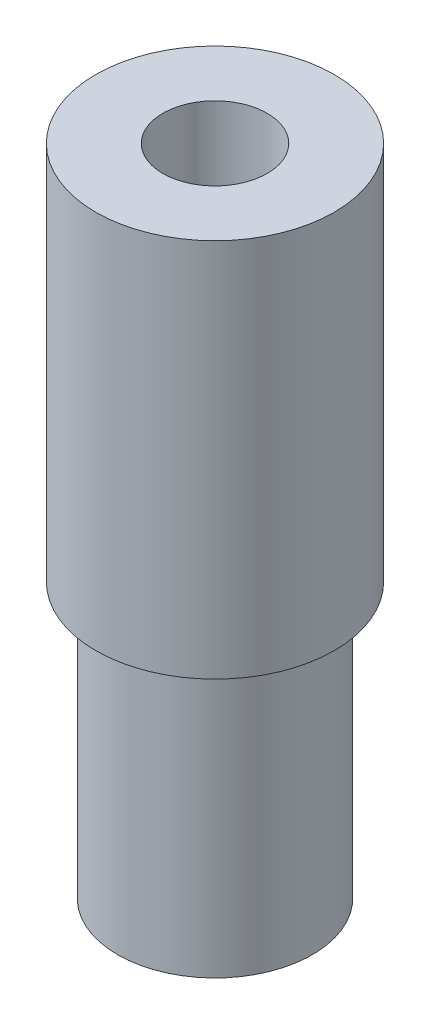
ISO-10303-21;
HEADER;
FILE_DESCRIPTION(('STEP AP214'),'2;1');
FILE_NAME('part.step','',(''),(''),'','','');
FILE_SCHEMA(('AUTOMOTIVE_DESIGN { 1 0 10303 214 1 1 1 1 }'));
ENDSEC;
DATA;
#1=APPLICATION_CONTEXT('core data for automotive mechanical design processes');
#2=APPLICATION_PROTOCOL_DEFINITION('international standard','automotive_design',2000,#1);
#3=PRODUCT_CONTEXT('',#1,'mechanical');
#4=PRODUCT('Part','Part','',(#3));
#5=PRODUCT_RELATED_PRODUCT_CATEGORY('part','',(#4));
#6=PRODUCT_DEFINITION_FORMATION('','',#4);
#7=PRODUCT_DEFINITION_CONTEXT('part definition',#1,'design');
#8=PRODUCT_DEFINITION('design','',#6,#7);
#9=PRODUCT_DEFINITION_SHAPE('','',#8);
#10=(LENGTH_UNIT() NAMED_UNIT(*) SI_UNIT(.MILLI.,.METRE.));
#11=(NAMED_UNIT(*) PLANE_ANGLE_UNIT() SI_UNIT($,.RADIAN.));
#12=(NAMED_UNIT(*) SI_UNIT($,.STERADIAN.) SOLID_ANGLE_UNIT());
#13=UNCERTAINTY_MEASURE_WITH_UNIT(LENGTH_MEASURE(1.E-05),#10,'distance_accuracy_value','');
#14=(GEOMETRIC_REPRESENTATION_CONTEXT(3) GLOBAL_UNCERTAINTY_ASSIGNED_CONTEXT((#13)) GLOBAL_UNIT_ASSIGNED_CONTEXT((#10,
#11,#12)) REPRESENTATION_CONTEXT('',''));
#15=CARTESIAN_POINT('',(0.,0.,0.));
#16=DIRECTION('',(0.,0.,1.));
#17=DIRECTION('',(1.,0.,0.));
#18=AXIS2_PLACEMENT_3D('',#15,#16,#17);
#19=CARTESIAN_POINT('',(0.,13.8,0.));
#20=DIRECTION('',(0.,-1.,0.));
#21=DIRECTION('',(0.,0.,-1.));
#22=AXIS2_PLACEMENT_3D('',#19,#20,#21);
#23=CYLINDRICAL_SURFACE('',#22,4.9);
#24=CARTESIAN_POINT('',(0.,13.8,0.));
#25=DIRECTION('',(0.,1.,0.));
#26=DIRECTION('',(0.,0.,1.));
#27=AXIS2_PLACEMENT_3D('',#24,#25,#26);
#28=CIRCLE('',#27,4.9);
#29=CARTESIAN_POINT('',(0.,13.8,4.9));
#30=VERTEX_POINT('',#29);
#31=EDGE_CURVE('E41',#30,#30,#28,.T.);
#32=ORIENTED_EDGE('',*,*,#31,.F.);
#33=EDGE_LOOP('',(#32));
#34=FACE_BOUND('',#33,.T.);
#35=CARTESIAN_POINT('',(0.,0.,0.));
#36=DIRECTION('',(0.,1.,0.));
#37=DIRECTION('',(0.,0.,1.));
#38=AXIS2_PLACEMENT_3D('',#35,#36,#37);
#39=CIRCLE('',#38,4.9);
#40=CARTESIAN_POINT('',(0.,0.,4.9));
#41=VERTEX_POINT('',#40);
#42=EDGE_CURVE('E45',#41,#41,#39,.T.);
#43=ORIENTED_EDGE('',*,*,#42,.T.);
#44=EDGE_LOOP('',(#43));
#45=FACE_BOUND('',#44,.T.);
#46=ADVANCED_FACE('F30',(#34,#45),#23,.T.);
#47=CARTESIAN_POINT('',(0.,0.,0.));
#48=DIRECTION('',(0.,1.,0.));
#49=DIRECTION('',(0.,0.,1.));
#50=AXIS2_PLACEMENT_3D('',#47,#48,#49);
#51=PLANE('',#50);
#52=CARTESIAN_POINT('',(0.,0.,0.));
#53=DIRECTION('',(0.,1.,0.));
#54=DIRECTION('',(0.,0.,1.));
#55=AXIS2_PLACEMENT_3D('',#52,#53,#54);
#56=CIRCLE('',#55,3.025);
#57=CARTESIAN_POINT('',(0.,0.,3.025));
#58=VERTEX_POINT('',#57);
#59=EDGE_CURVE('E37',#58,#58,#56,.T.);
#60=ORIENTED_EDGE('',*,*,#59,.T.);
#61=EDGE_LOOP('',(#60));
#62=FACE_BOUND('',#61,.T.);
#63=ORIENTED_EDGE('',*,*,#42,.F.);
#64=EDGE_LOOP('',(#63));
#65=FACE_BOUND('',#64,.T.);
#66=ADVANCED_FACE('F72',(#62,#65),#51,.F.);
#67=CARTESIAN_POINT('',(0.,32.9,0.));
#68=DIRECTION('',(0.,-1.,0.));
#69=DIRECTION('',(0.,0.,-1.));
#70=AXIS2_PLACEMENT_3D('',#67,#68,#69);
#71=CYLINDRICAL_SURFACE('',#70,6.);
#72=CARTESIAN_POINT('',(0.,32.9,0.));
#73=DIRECTION('',(0.,1.,0.));
#74=DIRECTION('',(0.,0.,1.));
#75=AXIS2_PLACEMENT_3D('',#72,#73,#74);
#76=CIRCLE('',#75,6.);
#77=CARTESIAN_POINT('',(0.,32.9,6.));
#78=VERTEX_POINT('',#77);
#79=EDGE_CURVE('E49',#78,#78,#76,.T.);
#80=ORIENTED_EDGE('',*,*,#79,.F.);
#81=EDGE_LOOP('',(#80));
#82=FACE_BOUND('',#81,.T.);
#83=CARTESIAN_POINT('',(0.,13.8,0.));
#84=DIRECTION('',(0.,1.,0.));
#85=DIRECTION('',(0.,0.,1.));
#86=AXIS2_PLACEMENT_3D('',#83,#84,#85);
#87=CIRCLE('',#86,6.);
#88=CARTESIAN_POINT('',(0.,13.8,6.));
#89=VERTEX_POINT('',#88);
#90=EDGE_CURVE('E51',#89,#89,#87,.T.);
#91=ORIENTED_EDGE('',*,*,#90,.T.);
#92=EDGE_LOOP('',(#91));
#93=FACE_BOUND('',#92,.T.);
#94=ADVANCED_FACE('F66',(#82,#93),#71,.T.);
#95=CARTESIAN_POINT('',(0.,32.9,0.));
#96=DIRECTION('',(0.,1.,0.));
#97=DIRECTION('',(0.,0.,1.));
#98=AXIS2_PLACEMENT_3D('',#95,#96,#97);
#99=PLANE('',#98);
#100=CARTESIAN_POINT('',(0.,32.9,0.));
#101=DIRECTION('',(0.,1.,0.));
#102=DIRECTION('',(0.,0.,1.));
#103=AXIS2_PLACEMENT_3D('',#100,#101,#102);
#104=CIRCLE('',#103,2.625);
#105=CARTESIAN_POINT('',(0.,32.9,2.625));
#106=VERTEX_POINT('',#105);
#107=EDGE_CURVE('E54',#106,#106,#104,.T.);
#108=ORIENTED_EDGE('',*,*,#107,.F.);
#109=EDGE_LOOP('',(#108));
#110=FACE_BOUND('',#109,.T.);
#111=ORIENTED_EDGE('',*,*,#79,.T.);
#112=EDGE_LOOP('',(#111));
#113=FACE_BOUND('',#112,.T.);
#114=ADVANCED_FACE('F62',(#110,#113),#99,.T.);
#115=CARTESIAN_POINT('',(0.,13.8,0.));
#116=DIRECTION('',(0.,1.,0.));
#117=DIRECTION('',(0.,0.,1.));
#118=AXIS2_PLACEMENT_3D('',#115,#116,#117);
#119=PLANE('',#118);
#120=ORIENTED_EDGE('',*,*,#31,.T.);
#121=EDGE_LOOP('',(#120));
#122=FACE_BOUND('',#121,.T.);
#123=ORIENTED_EDGE('',*,*,#90,.F.);
#124=EDGE_LOOP('',(#123));
#125=FACE_BOUND('',#124,.T.);
#126=ADVANCED_FACE('F65',(#122,#125),#119,.F.);
#127=CARTESIAN_POINT('',(0.,32.9,0.));
#128=DIRECTION('',(0.,-1.,0.));
#129=DIRECTION('',(0.,0.,-1.));
#130=AXIS2_PLACEMENT_3D('',#127,#128,#129);
#131=CYLINDRICAL_SURFACE('',#130,2.625);
#132=CARTESIAN_POINT('',(0.,0.400000000000005,0.));
#133=DIRECTION('',(0.,1.,0.));
#134=DIRECTION('',(0.,0.,1.));
#135=AXIS2_PLACEMENT_3D('',#132,#133,#134);
#136=CIRCLE('',#135,2.625);
#137=CARTESIAN_POINT('',(0.,0.400000000000005,2.625));
#138=VERTEX_POINT('',#137);
#139=EDGE_CURVE('E10',#138,#138,#136,.F.);
#140=ORIENTED_EDGE('',*,*,#139,.T.);
#141=EDGE_LOOP('',(#140));
#142=FACE_BOUND('',#141,.T.);
#143=ORIENTED_EDGE('',*,*,#107,.T.);
#144=EDGE_LOOP('',(#143));
#145=FACE_BOUND('',#144,.T.);
#146=ADVANCED_FACE('F60',(#142,#145),#131,.F.);
#147=CARTESIAN_POINT('',(0.,0.,0.));
#148=DIRECTION('',(0.,-1.,0.));
#149=DIRECTION('',(0.,0.,-1.));
#150=AXIS2_PLACEMENT_3D('',#147,#148,#149);
#151=CONICAL_SURFACE('',#150,3.025,0.785398163397447);
#152=ORIENTED_EDGE('',*,*,#139,.F.);
#153=EDGE_LOOP('',(#152));
#154=FACE_BOUND('',#153,.T.);
#155=ORIENTED_EDGE('',*,*,#59,.F.);
#156=EDGE_LOOP('',(#155));
#157=FACE_BOUND('',#156,.T.);
#158=ADVANCED_FACE('F32',(#154,#157),#151,.F.);
#159=CLOSED_SHELL('',(#46,#66,#94,#114,#126,#146,#158));
#160=MANIFOLD_SOLID_BREP('B2',#159);
#161=ADVANCED_BREP_SHAPE_REPRESENTATION('',(#18,#160),#14);
#162=SHAPE_DEFINITION_REPRESENTATION(#9,#161);
ENDSEC;
END-ISO-10303-21;
